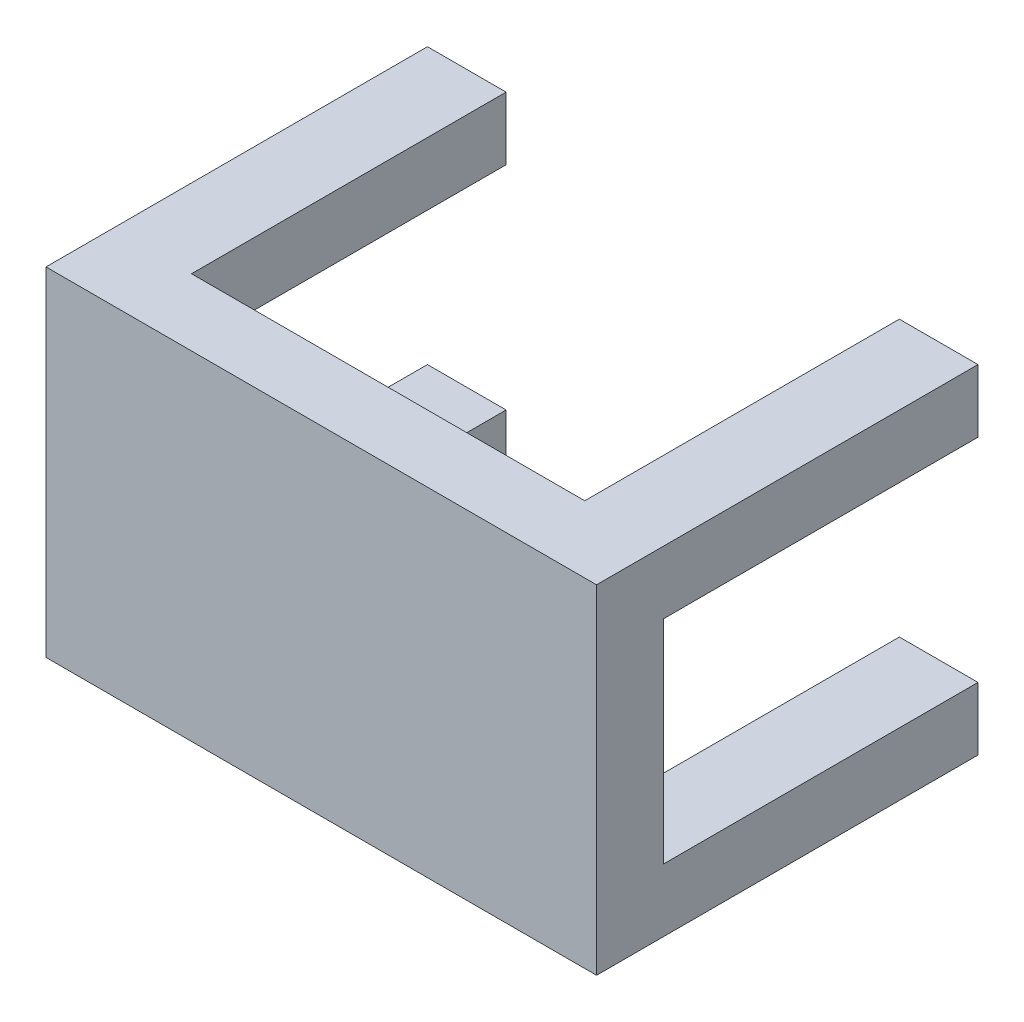
ISO-10303-21;
HEADER;
FILE_DESCRIPTION(('STEP AP214'),'2;1');
FILE_NAME('part.step','',(''),(''),'','','');
FILE_SCHEMA(('AUTOMOTIVE_DESIGN { 1 0 10303 214 1 1 1 1 }'));
ENDSEC;
DATA;
#1=APPLICATION_CONTEXT('core data for automotive mechanical design processes');
#2=APPLICATION_PROTOCOL_DEFINITION('international standard','automotive_design',2000,#1);
#3=PRODUCT_CONTEXT('',#1,'mechanical');
#4=PRODUCT('Part','Part','',(#3));
#5=PRODUCT_RELATED_PRODUCT_CATEGORY('part','',(#4));
#6=PRODUCT_DEFINITION_FORMATION('','',#4);
#7=PRODUCT_DEFINITION_CONTEXT('part definition',#1,'design');
#8=PRODUCT_DEFINITION('design','',#6,#7);
#9=PRODUCT_DEFINITION_SHAPE('','',#8);
#10=(LENGTH_UNIT() NAMED_UNIT(*) SI_UNIT(.MILLI.,.METRE.));
#11=(NAMED_UNIT(*) PLANE_ANGLE_UNIT() SI_UNIT($,.RADIAN.));
#12=(NAMED_UNIT(*) SI_UNIT($,.STERADIAN.) SOLID_ANGLE_UNIT());
#13=UNCERTAINTY_MEASURE_WITH_UNIT(LENGTH_MEASURE(1.E-05),#10,'distance_accuracy_value','');
#14=(GEOMETRIC_REPRESENTATION_CONTEXT(3) GLOBAL_UNCERTAINTY_ASSIGNED_CONTEXT((#13)) GLOBAL_UNIT_ASSIGNED_CONTEXT((#10,
#11,#12)) REPRESENTATION_CONTEXT('',''));
#15=CARTESIAN_POINT('',(0.,0.,0.));
#16=DIRECTION('',(0.,0.,1.));
#17=DIRECTION('',(1.,0.,0.));
#18=AXIS2_PLACEMENT_3D('',#15,#16,#17);
#19=CARTESIAN_POINT('',(-35.,21.5,48.5));
#20=DIRECTION('',(0.,-1.,0.));
#21=DIRECTION('',(0.,0.,-1.));
#22=AXIS2_PLACEMENT_3D('',#19,#20,#21);
#23=PLANE('',#22);
#24=DIRECTION('',(0.,0.,-1.));
#25=VECTOR('',#24,1.);
#26=CARTESIAN_POINT('',(25.,21.5,40.));
#27=LINE('',#26,#25);
#28=CARTESIAN_POINT('',(25.,21.5,40.));
#29=VERTEX_POINT('',#28);
#30=CARTESIAN_POINT('',(25.,21.5,0.));
#31=VERTEX_POINT('',#30);
#32=EDGE_CURVE('E301',#29,#31,#27,.T.);
#33=ORIENTED_EDGE('',*,*,#32,.F.);
#34=DIRECTION('',(1.,0.,0.));
#35=VECTOR('',#34,1.);
#36=CARTESIAN_POINT('',(0.,21.5,40.));
#37=LINE('',#36,#35);
#38=CARTESIAN_POINT('',(-25.,21.5,40.));
#39=VERTEX_POINT('',#38);
#40=EDGE_CURVE('E248',#39,#29,#37,.T.);
#41=ORIENTED_EDGE('',*,*,#40,.F.);
#42=DIRECTION('',(0.,0.,-1.));
#43=VECTOR('',#42,1.);
#44=CARTESIAN_POINT('',(-25.,21.5,40.));
#45=LINE('',#44,#43);
#46=CARTESIAN_POINT('',(-25.,21.5,0.));
#47=VERTEX_POINT('',#46);
#48=EDGE_CURVE('E304',#39,#47,#45,.T.);
#49=ORIENTED_EDGE('',*,*,#48,.T.);
#50=DIRECTION('',(-1.,0.,0.));
#51=VECTOR('',#50,1.);
#52=CARTESIAN_POINT('',(-35.,21.5,0.));
#53=LINE('',#52,#51);
#54=CARTESIAN_POINT('',(-35.,21.5,0.));
#55=VERTEX_POINT('',#54);
#56=EDGE_CURVE('E345',#47,#55,#53,.T.);
#57=ORIENTED_EDGE('',*,*,#56,.T.);
#58=DIRECTION('',(0.,0.,-1.));
#59=VECTOR('',#58,1.);
#60=CARTESIAN_POINT('',(-35.,21.5,48.5));
#61=LINE('',#60,#59);
#62=CARTESIAN_POINT('',(-35.,21.5,48.5));
#63=VERTEX_POINT('',#62);
#64=EDGE_CURVE('E51',#63,#55,#61,.T.);
#65=ORIENTED_EDGE('',*,*,#64,.F.);
#66=DIRECTION('',(-1.,0.,0.));
#67=VECTOR('',#66,1.);
#68=CARTESIAN_POINT('',(-35.,21.5,48.5));
#69=LINE('',#68,#67);
#70=CARTESIAN_POINT('',(35.,21.5,48.5));
#71=VERTEX_POINT('',#70);
#72=EDGE_CURVE('E95',#71,#63,#69,.T.);
#73=ORIENTED_EDGE('',*,*,#72,.F.);
#74=DIRECTION('',(0.,0.,-1.));
#75=VECTOR('',#74,1.);
#76=CARTESIAN_POINT('',(35.,21.5,48.5));
#77=LINE('',#76,#75);
#78=CARTESIAN_POINT('',(35.,21.5,0.));
#79=VERTEX_POINT('',#78);
#80=EDGE_CURVE('E11',#71,#79,#77,.T.);
#81=ORIENTED_EDGE('',*,*,#80,.T.);
#82=EDGE_CURVE('E346',#79,#31,#53,.T.);
#83=ORIENTED_EDGE('',*,*,#82,.T.);
#84=EDGE_LOOP('',(#33,#41,#49,#57,#65,#73,#81,#83));
#85=FACE_BOUND('',#84,.T.);
#86=ADVANCED_FACE('F42',(#85),#23,.F.);
#87=CARTESIAN_POINT('',(0.,0.,0.));
#88=DIRECTION('',(0.,0.,-1.));
#89=DIRECTION('',(-1.,0.,0.));
#90=AXIS2_PLACEMENT_3D('',#87,#88,#89);
#91=PLANE('',#90);
#92=CARTESIAN_POINT('',(-30.,17.5,0.));
#93=DIRECTION('',(0.,0.,-1.));
#94=DIRECTION('',(-1.,0.,0.));
#95=AXIS2_PLACEMENT_3D('',#92,#93,#94);
#96=CIRCLE('',#95,1.25);
#97=CARTESIAN_POINT('',(-31.25,17.5,0.));
#98=VERTEX_POINT('',#97);
#99=EDGE_CURVE('E186',#98,#98,#96,.T.);
#100=ORIENTED_EDGE('',*,*,#99,.F.);
#101=EDGE_LOOP('',(#100));
#102=FACE_BOUND('',#101,.T.);
#103=ORIENTED_EDGE('',*,*,#56,.F.);
#104=DIRECTION('',(0.,-1.,0.));
#105=VECTOR('',#104,1.);
#106=CARTESIAN_POINT('',(-25.,0.,0.));
#107=LINE('',#106,#105);
#108=CARTESIAN_POINT('',(-25.,13.5,0.));
#109=VERTEX_POINT('',#108);
#110=EDGE_CURVE('E280',#47,#109,#107,.T.);
#111=ORIENTED_EDGE('',*,*,#110,.T.);
#112=DIRECTION('',(1.,0.,0.));
#113=VECTOR('',#112,1.);
#114=CARTESIAN_POINT('',(0.,13.5,0.));
#115=LINE('',#114,#113);
#116=CARTESIAN_POINT('',(-35.,13.5,0.));
#117=VERTEX_POINT('',#116);
#118=EDGE_CURVE('E276',#117,#109,#115,.T.);
#119=ORIENTED_EDGE('',*,*,#118,.F.);
#120=DIRECTION('',(0.,-1.,0.));
#121=VECTOR('',#120,1.);
#122=CARTESIAN_POINT('',(-35.,-21.5,0.));
#123=LINE('',#122,#121);
#124=EDGE_CURVE('E351',#55,#117,#123,.T.);
#125=ORIENTED_EDGE('',*,*,#124,.F.);
#126=EDGE_LOOP('',(#103,#111,#119,#125));
#127=FACE_BOUND('',#126,.T.);
#128=ADVANCED_FACE('F374',(#102,#127),#91,.T.);
#129=CARTESIAN_POINT('',(30.,17.5,0.));
#130=DIRECTION('',(0.,0.,-1.));
#131=DIRECTION('',(-1.,0.,0.));
#132=AXIS2_PLACEMENT_3D('',#129,#130,#131);
#133=CIRCLE('',#132,1.25);
#134=CARTESIAN_POINT('',(28.75,17.5,0.));
#135=VERTEX_POINT('',#134);
#136=EDGE_CURVE('E187',#135,#135,#133,.T.);
#137=ORIENTED_EDGE('',*,*,#136,.F.);
#138=EDGE_LOOP('',(#137));
#139=FACE_BOUND('',#138,.T.);
#140=DIRECTION('',(1.,0.,0.));
#141=VECTOR('',#140,1.);
#142=CARTESIAN_POINT('',(0.,13.5,0.));
#143=LINE('',#142,#141);
#144=CARTESIAN_POINT('',(25.,13.5,0.));
#145=VERTEX_POINT('',#144);
#146=CARTESIAN_POINT('',(35.,13.5,0.));
#147=VERTEX_POINT('',#146);
#148=EDGE_CURVE('E221',#145,#147,#143,.T.);
#149=ORIENTED_EDGE('',*,*,#148,.F.);
#150=DIRECTION('',(0.,1.,0.));
#151=VECTOR('',#150,1.);
#152=CARTESIAN_POINT('',(25.,0.,0.));
#153=LINE('',#152,#151);
#154=EDGE_CURVE('E284',#145,#31,#153,.T.);
#155=ORIENTED_EDGE('',*,*,#154,.T.);
#156=ORIENTED_EDGE('',*,*,#82,.F.);
#157=DIRECTION('',(0.,1.,0.));
#158=VECTOR('',#157,1.);
#159=CARTESIAN_POINT('',(35.,-21.5,0.));
#160=LINE('',#159,#158);
#161=EDGE_CURVE('E293',#147,#79,#160,.T.);
#162=ORIENTED_EDGE('',*,*,#161,.F.);
#163=EDGE_LOOP('',(#149,#155,#156,#162));
#164=FACE_BOUND('',#163,.T.);
#165=ADVANCED_FACE('F403',(#139,#164),#91,.T.);
#166=CARTESIAN_POINT('',(-30.,-17.5,0.));
#167=DIRECTION('',(0.,0.,-1.));
#168=DIRECTION('',(-1.,0.,0.));
#169=AXIS2_PLACEMENT_3D('',#166,#167,#168);
#170=CIRCLE('',#169,1.25);
#171=CARTESIAN_POINT('',(-31.25,-17.5,0.));
#172=VERTEX_POINT('',#171);
#173=EDGE_CURVE('E200',#172,#172,#170,.T.);
#174=ORIENTED_EDGE('',*,*,#173,.F.);
#175=EDGE_LOOP('',(#174));
#176=FACE_BOUND('',#175,.T.);
#177=DIRECTION('',(-1.,0.,0.));
#178=VECTOR('',#177,1.);
#179=CARTESIAN_POINT('',(0.,-13.5,0.));
#180=LINE('',#179,#178);
#181=CARTESIAN_POINT('',(-25.,-13.5,0.));
#182=VERTEX_POINT('',#181);
#183=CARTESIAN_POINT('',(-35.,-13.5,0.));
#184=VERTEX_POINT('',#183);
#185=EDGE_CURVE('E273',#182,#184,#180,.T.);
#186=ORIENTED_EDGE('',*,*,#185,.F.);
#187=DIRECTION('',(0.,1.,0.));
#188=VECTOR('',#187,1.);
#189=CARTESIAN_POINT('',(-25.,0.,0.));
#190=LINE('',#189,#188);
#191=CARTESIAN_POINT('',(-25.,-21.5,0.));
#192=VERTEX_POINT('',#191);
#193=EDGE_CURVE('E269',#192,#182,#190,.T.);
#194=ORIENTED_EDGE('',*,*,#193,.F.);
#195=DIRECTION('',(1.,0.,0.));
#196=VECTOR('',#195,1.);
#197=CARTESIAN_POINT('',(-35.,-21.5,0.));
#198=LINE('',#197,#196);
#199=CARTESIAN_POINT('',(-35.,-21.5,0.));
#200=VERTEX_POINT('',#199);
#201=EDGE_CURVE('E332',#200,#192,#198,.T.);
#202=ORIENTED_EDGE('',*,*,#201,.F.);
#203=EDGE_CURVE('E350',#184,#200,#123,.T.);
#204=ORIENTED_EDGE('',*,*,#203,.F.);
#205=EDGE_LOOP('',(#186,#194,#202,#204));
#206=FACE_BOUND('',#205,.T.);
#207=ADVANCED_FACE('F389',(#176,#206),#91,.T.);
#208=CARTESIAN_POINT('',(35.,-21.5,48.5));
#209=DIRECTION('',(-1.,0.,0.));
#210=DIRECTION('',(0.,0.,1.));
#211=AXIS2_PLACEMENT_3D('',#208,#209,#210);
#212=PLANE('',#211);
#213=CARTESIAN_POINT('',(35.,-21.5,0.));
#214=VERTEX_POINT('',#213);
#215=CARTESIAN_POINT('',(35.,-13.5,0.));
#216=VERTEX_POINT('',#215);
#217=EDGE_CURVE('E341',#214,#216,#160,.T.);
#218=ORIENTED_EDGE('',*,*,#217,.T.);
#219=DIRECTION('',(0.,0.,-1.));
#220=VECTOR('',#219,1.);
#221=CARTESIAN_POINT('',(35.,-13.5,40.));
#222=LINE('',#221,#220);
#223=CARTESIAN_POINT('',(35.,-13.5,40.));
#224=VERTEX_POINT('',#223);
#225=EDGE_CURVE('E290',#224,#216,#222,.T.);
#226=ORIENTED_EDGE('',*,*,#225,.F.);
#227=DIRECTION('',(0.,-1.,0.));
#228=VECTOR('',#227,1.);
#229=CARTESIAN_POINT('',(35.,0.,40.));
#230=LINE('',#229,#228);
#231=CARTESIAN_POINT('',(35.,13.5,40.));
#232=VERTEX_POINT('',#231);
#233=EDGE_CURVE('E259',#232,#224,#230,.T.);
#234=ORIENTED_EDGE('',*,*,#233,.F.);
#235=DIRECTION('',(0.,0.,-1.));
#236=VECTOR('',#235,1.);
#237=CARTESIAN_POINT('',(35.,13.5,40.));
#238=LINE('',#237,#236);
#239=EDGE_CURVE('E294',#232,#147,#238,.T.);
#240=ORIENTED_EDGE('',*,*,#239,.T.);
#241=ORIENTED_EDGE('',*,*,#161,.T.);
#242=ORIENTED_EDGE('',*,*,#80,.F.);
#243=DIRECTION('',(0.,1.,0.));
#244=VECTOR('',#243,1.);
#245=CARTESIAN_POINT('',(35.,-21.5,48.5));
#246=LINE('',#245,#244);
#247=CARTESIAN_POINT('',(35.,-21.5,48.5));
#248=VERTEX_POINT('',#247);
#249=EDGE_CURVE('E329',#248,#71,#246,.T.);
#250=ORIENTED_EDGE('',*,*,#249,.F.);
#251=DIRECTION('',(0.,0.,-1.));
#252=VECTOR('',#251,1.);
#253=CARTESIAN_POINT('',(35.,-21.5,48.5));
#254=LINE('',#253,#252);
#255=EDGE_CURVE('E340',#248,#214,#254,.T.);
#256=ORIENTED_EDGE('',*,*,#255,.T.);
#257=EDGE_LOOP('',(#218,#226,#234,#240,#241,#242,#250,#256));
#258=FACE_BOUND('',#257,.T.);
#259=ADVANCED_FACE('F44',(#258),#212,.F.);
#260=CARTESIAN_POINT('',(-35.,-21.5,48.5));
#261=DIRECTION('',(1.,0.,0.));
#262=DIRECTION('',(0.,0.,-1.));
#263=AXIS2_PLACEMENT_3D('',#260,#261,#262);
#264=PLANE('',#263);
#265=ORIENTED_EDGE('',*,*,#124,.T.);
#266=DIRECTION('',(0.,0.,-1.));
#267=VECTOR('',#266,1.);
#268=CARTESIAN_POINT('',(-35.,13.5,40.));
#269=LINE('',#268,#267);
#270=CARTESIAN_POINT('',(-35.,13.5,40.));
#271=VERTEX_POINT('',#270);
#272=EDGE_CURVE('E311',#271,#117,#269,.T.);
#273=ORIENTED_EDGE('',*,*,#272,.F.);
#274=DIRECTION('',(0.,1.,0.));
#275=VECTOR('',#274,1.);
#276=CARTESIAN_POINT('',(-35.,0.,40.));
#277=LINE('',#276,#275);
#278=CARTESIAN_POINT('',(-35.,-13.5,40.));
#279=VERTEX_POINT('',#278);
#280=EDGE_CURVE('E237',#279,#271,#277,.T.);
#281=ORIENTED_EDGE('',*,*,#280,.F.);
#282=DIRECTION('',(0.,0.,-1.));
#283=VECTOR('',#282,1.);
#284=CARTESIAN_POINT('',(-35.,-13.5,40.));
#285=LINE('',#284,#283);
#286=EDGE_CURVE('E314',#279,#184,#285,.T.);
#287=ORIENTED_EDGE('',*,*,#286,.T.);
#288=ORIENTED_EDGE('',*,*,#203,.T.);
#289=DIRECTION('',(0.,0.,-1.));
#290=VECTOR('',#289,1.);
#291=CARTESIAN_POINT('',(-35.,-21.5,48.5));
#292=LINE('',#291,#290);
#293=CARTESIAN_POINT('',(-35.,-21.5,48.5));
#294=VERTEX_POINT('',#293);
#295=EDGE_CURVE('E360',#294,#200,#292,.T.);
#296=ORIENTED_EDGE('',*,*,#295,.F.);
#297=DIRECTION('',(0.,-1.,0.));
#298=VECTOR('',#297,1.);
#299=CARTESIAN_POINT('',(-35.,-21.5,48.5));
#300=LINE('',#299,#298);
#301=EDGE_CURVE('E335',#63,#294,#300,.T.);
#302=ORIENTED_EDGE('',*,*,#301,.F.);
#303=ORIENTED_EDGE('',*,*,#64,.T.);
#304=EDGE_LOOP('',(#265,#273,#281,#287,#288,#296,#302,#303));
#305=FACE_BOUND('',#304,.T.);
#306=ADVANCED_FACE('F368',(#305),#264,.F.);
#307=CARTESIAN_POINT('',(-35.,-21.5,48.5));
#308=DIRECTION('',(0.,1.,0.));
#309=DIRECTION('',(0.,0.,1.));
#310=AXIS2_PLACEMENT_3D('',#307,#308,#309);
#311=PLANE('',#310);
#312=ORIENTED_EDGE('',*,*,#201,.T.);
#313=DIRECTION('',(0.,0.,-1.));
#314=VECTOR('',#313,1.);
#315=CARTESIAN_POINT('',(-25.,-21.5,40.));
#316=LINE('',#315,#314);
#317=CARTESIAN_POINT('',(-25.,-21.5,40.));
#318=VERTEX_POINT('',#317);
#319=EDGE_CURVE('E321',#318,#192,#316,.T.);
#320=ORIENTED_EDGE('',*,*,#319,.F.);
#321=DIRECTION('',(-1.,0.,0.));
#322=VECTOR('',#321,1.);
#323=CARTESIAN_POINT('',(0.,-21.5,40.));
#324=LINE('',#323,#322);
#325=CARTESIAN_POINT('',(25.,-21.5,40.));
#326=VERTEX_POINT('',#325);
#327=EDGE_CURVE('E225',#326,#318,#324,.T.);
#328=ORIENTED_EDGE('',*,*,#327,.F.);
#329=DIRECTION('',(0.,0.,-1.));
#330=VECTOR('',#329,1.);
#331=CARTESIAN_POINT('',(25.,-21.5,40.));
#332=LINE('',#331,#330);
#333=CARTESIAN_POINT('',(25.,-21.5,0.));
#334=VERTEX_POINT('',#333);
#335=EDGE_CURVE('E324',#326,#334,#332,.T.);
#336=ORIENTED_EDGE('',*,*,#335,.T.);
#337=EDGE_CURVE('E88',#334,#214,#198,.T.);
#338=ORIENTED_EDGE('',*,*,#337,.T.);
#339=ORIENTED_EDGE('',*,*,#255,.F.);
#340=DIRECTION('',(1.,0.,0.));
#341=VECTOR('',#340,1.);
#342=CARTESIAN_POINT('',(-35.,-21.5,48.5));
#343=LINE('',#342,#341);
#344=EDGE_CURVE('E67',#294,#248,#343,.T.);
#345=ORIENTED_EDGE('',*,*,#344,.F.);
#346=ORIENTED_EDGE('',*,*,#295,.T.);
#347=EDGE_LOOP('',(#312,#320,#328,#336,#338,#339,#345,#346));
#348=FACE_BOUND('',#347,.T.);
#349=ADVANCED_FACE('F418',(#348),#311,.F.);
#350=CARTESIAN_POINT('',(0.,0.,48.5));
#351=DIRECTION('',(0.,0.,-1.));
#352=DIRECTION('',(-1.,0.,0.));
#353=AXIS2_PLACEMENT_3D('',#350,#351,#352);
#354=PLANE('',#353);
#355=ORIENTED_EDGE('',*,*,#249,.T.);
#356=ORIENTED_EDGE('',*,*,#72,.T.);
#357=ORIENTED_EDGE('',*,*,#301,.T.);
#358=ORIENTED_EDGE('',*,*,#344,.T.);
#359=EDGE_LOOP('',(#355,#356,#357,#358));
#360=FACE_BOUND('',#359,.T.);
#361=ADVANCED_FACE('F420',(#360),#354,.F.);
#362=CARTESIAN_POINT('',(30.,-17.5,0.));
#363=DIRECTION('',(0.,0.,-1.));
#364=DIRECTION('',(-1.,0.,0.));
#365=AXIS2_PLACEMENT_3D('',#362,#363,#364);
#366=CIRCLE('',#365,1.25);
#367=CARTESIAN_POINT('',(28.75,-17.5,0.));
#368=VERTEX_POINT('',#367);
#369=EDGE_CURVE('E208',#368,#368,#366,.T.);
#370=ORIENTED_EDGE('',*,*,#369,.F.);
#371=EDGE_LOOP('',(#370));
#372=FACE_BOUND('',#371,.T.);
#373=DIRECTION('',(-1.,0.,0.));
#374=VECTOR('',#373,1.);
#375=CARTESIAN_POINT('',(0.,-13.5,0.));
#376=LINE('',#375,#374);
#377=CARTESIAN_POINT('',(25.,-13.5,0.));
#378=VERTEX_POINT('',#377);
#379=EDGE_CURVE('E58',#216,#378,#376,.T.);
#380=ORIENTED_EDGE('',*,*,#379,.F.);
#381=ORIENTED_EDGE('',*,*,#217,.F.);
#382=ORIENTED_EDGE('',*,*,#337,.F.);
#383=DIRECTION('',(0.,-1.,0.));
#384=VECTOR('',#383,1.);
#385=CARTESIAN_POINT('',(25.,0.,0.));
#386=LINE('',#385,#384);
#387=EDGE_CURVE('E266',#378,#334,#386,.T.);
#388=ORIENTED_EDGE('',*,*,#387,.F.);
#389=EDGE_LOOP('',(#380,#381,#382,#388));
#390=FACE_BOUND('',#389,.T.);
#391=ADVANCED_FACE('F414',(#372,#390),#91,.T.);
#392=CARTESIAN_POINT('',(0.,-13.5,40.));
#393=DIRECTION('',(0.,-1.,0.));
#394=DIRECTION('',(1.,0.,0.));
#395=AXIS2_PLACEMENT_3D('',#392,#393,#394);
#396=PLANE('',#395);
#397=ORIENTED_EDGE('',*,*,#379,.T.);
#398=DIRECTION('',(0.,0.,-1.));
#399=VECTOR('',#398,1.);
#400=CARTESIAN_POINT('',(25.,-13.5,40.));
#401=LINE('',#400,#399);
#402=CARTESIAN_POINT('',(25.,-13.5,40.));
#403=VERTEX_POINT('',#402);
#404=EDGE_CURVE('E263',#403,#378,#401,.T.);
#405=ORIENTED_EDGE('',*,*,#404,.F.);
#406=DIRECTION('',(-1.,0.,0.));
#407=VECTOR('',#406,1.);
#408=CARTESIAN_POINT('',(0.,-13.5,40.));
#409=LINE('',#408,#407);
#410=EDGE_CURVE('E216',#224,#403,#409,.T.);
#411=ORIENTED_EDGE('',*,*,#410,.F.);
#412=ORIENTED_EDGE('',*,*,#225,.T.);
#413=EDGE_LOOP('',(#397,#405,#411,#412));
#414=FACE_BOUND('',#413,.T.);
#415=ADVANCED_FACE('F423',(#414),#396,.F.);
#416=CARTESIAN_POINT('',(0.,13.5,40.));
#417=DIRECTION('',(0.,1.,0.));
#418=DIRECTION('',(-1.,0.,0.));
#419=AXIS2_PLACEMENT_3D('',#416,#417,#418);
#420=PLANE('',#419);
#421=ORIENTED_EDGE('',*,*,#148,.T.);
#422=ORIENTED_EDGE('',*,*,#239,.F.);
#423=DIRECTION('',(1.,0.,0.));
#424=VECTOR('',#423,1.);
#425=CARTESIAN_POINT('',(0.,13.5,40.));
#426=LINE('',#425,#424);
#427=CARTESIAN_POINT('',(25.,13.5,40.));
#428=VERTEX_POINT('',#427);
#429=EDGE_CURVE('E255',#428,#232,#426,.T.);
#430=ORIENTED_EDGE('',*,*,#429,.F.);
#431=DIRECTION('',(0.,0.,-1.));
#432=VECTOR('',#431,1.);
#433=CARTESIAN_POINT('',(25.,13.5,40.));
#434=LINE('',#433,#432);
#435=EDGE_CURVE('E298',#428,#145,#434,.T.);
#436=ORIENTED_EDGE('',*,*,#435,.T.);
#437=EDGE_LOOP('',(#421,#422,#430,#436));
#438=FACE_BOUND('',#437,.T.);
#439=ADVANCED_FACE('F429',(#438),#420,.F.);
#440=CARTESIAN_POINT('',(25.,0.,40.));
#441=DIRECTION('',(-1.,0.,0.));
#442=DIRECTION('',(0.,0.,1.));
#443=AXIS2_PLACEMENT_3D('',#440,#441,#442);
#444=PLANE('',#443);
#445=ORIENTED_EDGE('',*,*,#154,.F.);
#446=ORIENTED_EDGE('',*,*,#435,.F.);
#447=DIRECTION('',(0.,1.,0.));
#448=VECTOR('',#447,1.);
#449=CARTESIAN_POINT('',(25.,0.,40.));
#450=LINE('',#449,#448);
#451=EDGE_CURVE('E252',#428,#29,#450,.T.);
#452=ORIENTED_EDGE('',*,*,#451,.T.);
#453=ORIENTED_EDGE('',*,*,#32,.T.);
#454=EDGE_LOOP('',(#445,#446,#452,#453));
#455=FACE_BOUND('',#454,.T.);
#456=ADVANCED_FACE('F445',(#455),#444,.T.);
#457=CARTESIAN_POINT('',(-25.,0.,40.));
#458=DIRECTION('',(1.,0.,0.));
#459=DIRECTION('',(0.,0.,-1.));
#460=AXIS2_PLACEMENT_3D('',#457,#458,#459);
#461=PLANE('',#460);
#462=ORIENTED_EDGE('',*,*,#110,.F.);
#463=ORIENTED_EDGE('',*,*,#48,.F.);
#464=DIRECTION('',(0.,-1.,0.));
#465=VECTOR('',#464,1.);
#466=CARTESIAN_POINT('',(-25.,0.,40.));
#467=LINE('',#466,#465);
#468=CARTESIAN_POINT('',(-25.,13.5,40.));
#469=VERTEX_POINT('',#468);
#470=EDGE_CURVE('E245',#39,#469,#467,.T.);
#471=ORIENTED_EDGE('',*,*,#470,.T.);
#472=DIRECTION('',(0.,0.,-1.));
#473=VECTOR('',#472,1.);
#474=CARTESIAN_POINT('',(-25.,13.5,40.));
#475=LINE('',#474,#473);
#476=EDGE_CURVE('E308',#469,#109,#475,.T.);
#477=ORIENTED_EDGE('',*,*,#476,.T.);
#478=EDGE_LOOP('',(#462,#463,#471,#477));
#479=FACE_BOUND('',#478,.T.);
#480=ADVANCED_FACE('F442',(#479),#461,.T.);
#481=CARTESIAN_POINT('',(0.,13.5,40.));
#482=DIRECTION('',(0.,1.,0.));
#483=DIRECTION('',(0.,0.,1.));
#484=AXIS2_PLACEMENT_3D('',#481,#482,#483);
#485=PLANE('',#484);
#486=ORIENTED_EDGE('',*,*,#118,.T.);
#487=ORIENTED_EDGE('',*,*,#476,.F.);
#488=DIRECTION('',(1.,0.,0.));
#489=VECTOR('',#488,1.);
#490=CARTESIAN_POINT('',(0.,13.5,40.));
#491=LINE('',#490,#489);
#492=EDGE_CURVE('E241',#271,#469,#491,.T.);
#493=ORIENTED_EDGE('',*,*,#492,.F.);
#494=ORIENTED_EDGE('',*,*,#272,.T.);
#495=EDGE_LOOP('',(#486,#487,#493,#494));
#496=FACE_BOUND('',#495,.T.);
#497=ADVANCED_FACE('F377',(#496),#485,.F.);
#498=CARTESIAN_POINT('',(0.,-13.5,40.));
#499=DIRECTION('',(0.,-1.,0.));
#500=DIRECTION('',(1.,0.,0.));
#501=AXIS2_PLACEMENT_3D('',#498,#499,#500);
#502=PLANE('',#501);
#503=ORIENTED_EDGE('',*,*,#185,.T.);
#504=ORIENTED_EDGE('',*,*,#286,.F.);
#505=DIRECTION('',(-1.,0.,0.));
#506=VECTOR('',#505,1.);
#507=CARTESIAN_POINT('',(0.,-13.5,40.));
#508=LINE('',#507,#506);
#509=CARTESIAN_POINT('',(-25.,-13.5,40.));
#510=VERTEX_POINT('',#509);
#511=EDGE_CURVE('E233',#510,#279,#508,.T.);
#512=ORIENTED_EDGE('',*,*,#511,.F.);
#513=DIRECTION('',(0.,0.,-1.));
#514=VECTOR('',#513,1.);
#515=CARTESIAN_POINT('',(-25.,-13.5,40.));
#516=LINE('',#515,#514);
#517=EDGE_CURVE('E318',#510,#182,#516,.T.);
#518=ORIENTED_EDGE('',*,*,#517,.T.);
#519=EDGE_LOOP('',(#503,#504,#512,#518));
#520=FACE_BOUND('',#519,.T.);
#521=ADVANCED_FACE('F385',(#520),#502,.F.);
#522=CARTESIAN_POINT('',(-25.,0.,40.));
#523=DIRECTION('',(-1.,0.,0.));
#524=DIRECTION('',(0.,0.,1.));
#525=AXIS2_PLACEMENT_3D('',#522,#523,#524);
#526=PLANE('',#525);
#527=ORIENTED_EDGE('',*,*,#193,.T.);
#528=ORIENTED_EDGE('',*,*,#517,.F.);
#529=DIRECTION('',(0.,1.,0.));
#530=VECTOR('',#529,1.);
#531=CARTESIAN_POINT('',(-25.,0.,40.));
#532=LINE('',#531,#530);
#533=EDGE_CURVE('E229',#318,#510,#532,.T.);
#534=ORIENTED_EDGE('',*,*,#533,.F.);
#535=ORIENTED_EDGE('',*,*,#319,.T.);
#536=EDGE_LOOP('',(#527,#528,#534,#535));
#537=FACE_BOUND('',#536,.T.);
#538=ADVANCED_FACE('F433',(#537),#526,.F.);
#539=CARTESIAN_POINT('',(25.,0.,40.));
#540=DIRECTION('',(1.,0.,0.));
#541=DIRECTION('',(0.,0.,-1.));
#542=AXIS2_PLACEMENT_3D('',#539,#540,#541);
#543=PLANE('',#542);
#544=ORIENTED_EDGE('',*,*,#387,.T.);
#545=ORIENTED_EDGE('',*,*,#335,.F.);
#546=DIRECTION('',(0.,-1.,0.));
#547=VECTOR('',#546,1.);
#548=CARTESIAN_POINT('',(25.,0.,40.));
#549=LINE('',#548,#547);
#550=EDGE_CURVE('E220',#403,#326,#549,.T.);
#551=ORIENTED_EDGE('',*,*,#550,.F.);
#552=ORIENTED_EDGE('',*,*,#404,.T.);
#553=EDGE_LOOP('',(#544,#545,#551,#552));
#554=FACE_BOUND('',#553,.T.);
#555=ADVANCED_FACE('F430',(#554),#543,.F.);
#556=CARTESIAN_POINT('',(0.,0.,40.));
#557=DIRECTION('',(0.,0.,-1.));
#558=DIRECTION('',(-1.,0.,0.));
#559=AXIS2_PLACEMENT_3D('',#556,#557,#558);
#560=PLANE('',#559);
#561=ORIENTED_EDGE('',*,*,#410,.T.);
#562=ORIENTED_EDGE('',*,*,#550,.T.);
#563=ORIENTED_EDGE('',*,*,#327,.T.);
#564=ORIENTED_EDGE('',*,*,#533,.T.);
#565=ORIENTED_EDGE('',*,*,#511,.T.);
#566=ORIENTED_EDGE('',*,*,#280,.T.);
#567=ORIENTED_EDGE('',*,*,#492,.T.);
#568=ORIENTED_EDGE('',*,*,#470,.F.);
#569=ORIENTED_EDGE('',*,*,#40,.T.);
#570=ORIENTED_EDGE('',*,*,#451,.F.);
#571=ORIENTED_EDGE('',*,*,#429,.T.);
#572=ORIENTED_EDGE('',*,*,#233,.T.);
#573=EDGE_LOOP('',(#561,#562,#563,#564,#565,#566,#567,#568,#569,#570,#571,#572));
#574=FACE_BOUND('',#573,.T.);
#575=ADVANCED_FACE('F381',(#574),#560,.T.);
#576=CARTESIAN_POINT('',(30.,-17.5,15.));
#577=DIRECTION('',(0.,0.,-1.));
#578=DIRECTION('',(-1.,0.,0.));
#579=AXIS2_PLACEMENT_3D('',#576,#577,#578);
#580=CONICAL_SURFACE('',#579,1.25,1.02974425867665);
#581=CARTESIAN_POINT('',(30.,-17.5,15.7510757737845));
#582=VERTEX_POINT('',#581);
#583=VERTEX_LOOP('',#582);
#584=FACE_BOUND('',#583,.T.);
#585=CARTESIAN_POINT('',(30.,-17.5,15.));
#586=DIRECTION('',(0.,0.,-1.));
#587=DIRECTION('',(-1.,0.,0.));
#588=AXIS2_PLACEMENT_3D('',#585,#586,#587);
#589=CIRCLE('',#588,1.25);
#590=CARTESIAN_POINT('',(28.75,-17.5,15.));
#591=VERTEX_POINT('',#590);
#592=EDGE_CURVE('E212',#591,#591,#589,.T.);
#593=ORIENTED_EDGE('',*,*,#592,.T.);
#594=EDGE_LOOP('',(#593));
#595=FACE_BOUND('',#594,.T.);
#596=ADVANCED_FACE('F455',(#584,#595),#580,.F.);
#597=CARTESIAN_POINT('',(30.,-17.5,0.));
#598=DIRECTION('',(0.,0.,-1.));
#599=DIRECTION('',(-1.,0.,0.));
#600=AXIS2_PLACEMENT_3D('',#597,#598,#599);
#601=CYLINDRICAL_SURFACE('',#600,1.25);
#602=ORIENTED_EDGE('',*,*,#592,.F.);
#603=EDGE_LOOP('',(#602));
#604=FACE_BOUND('',#603,.T.);
#605=ORIENTED_EDGE('',*,*,#369,.T.);
#606=EDGE_LOOP('',(#605));
#607=FACE_BOUND('',#606,.T.);
#608=ADVANCED_FACE('F458',(#604,#607),#601,.F.);
#609=CARTESIAN_POINT('',(-30.,-17.5,15.));
#610=DIRECTION('',(0.,0.,-1.));
#611=DIRECTION('',(-1.,0.,0.));
#612=AXIS2_PLACEMENT_3D('',#609,#610,#611);
#613=CONICAL_SURFACE('',#612,1.25,1.02974425867665);
#614=CARTESIAN_POINT('',(-30.,-17.5,15.7510757737845));
#615=VERTEX_POINT('',#614);
#616=VERTEX_LOOP('',#615);
#617=FACE_BOUND('',#616,.T.);
#618=CARTESIAN_POINT('',(-30.,-17.5,15.));
#619=DIRECTION('',(0.,0.,-1.));
#620=DIRECTION('',(-1.,0.,0.));
#621=AXIS2_PLACEMENT_3D('',#618,#619,#620);
#622=CIRCLE('',#621,1.25);
#623=CARTESIAN_POINT('',(-31.25,-17.5,15.));
#624=VERTEX_POINT('',#623);
#625=EDGE_CURVE('E204',#624,#624,#622,.T.);
#626=ORIENTED_EDGE('',*,*,#625,.T.);
#627=EDGE_LOOP('',(#626));
#628=FACE_BOUND('',#627,.T.);
#629=ADVANCED_FACE('F462',(#617,#628),#613,.F.);
#630=CARTESIAN_POINT('',(-30.,-17.5,0.));
#631=DIRECTION('',(0.,0.,-1.));
#632=DIRECTION('',(-1.,0.,0.));
#633=AXIS2_PLACEMENT_3D('',#630,#631,#632);
#634=CYLINDRICAL_SURFACE('',#633,1.25);
#635=ORIENTED_EDGE('',*,*,#625,.F.);
#636=EDGE_LOOP('',(#635));
#637=FACE_BOUND('',#636,.T.);
#638=ORIENTED_EDGE('',*,*,#173,.T.);
#639=EDGE_LOOP('',(#638));
#640=FACE_BOUND('',#639,.T.);
#641=ADVANCED_FACE('F466',(#637,#640),#634,.F.);
#642=CARTESIAN_POINT('',(-30.,17.5,15.));
#643=DIRECTION('',(0.,0.,-1.));
#644=DIRECTION('',(-1.,0.,0.));
#645=AXIS2_PLACEMENT_3D('',#642,#643,#644);
#646=CONICAL_SURFACE('',#645,1.25,1.02974425867665);
#647=CARTESIAN_POINT('',(-30.,17.5,15.7510757737845));
#648=VERTEX_POINT('',#647);
#649=VERTEX_LOOP('',#648);
#650=FACE_BOUND('',#649,.T.);
#651=CARTESIAN_POINT('',(-30.,17.5,15.));
#652=DIRECTION('',(0.,0.,-1.));
#653=DIRECTION('',(-1.,0.,0.));
#654=AXIS2_PLACEMENT_3D('',#651,#652,#653);
#655=CIRCLE('',#654,1.25);
#656=CARTESIAN_POINT('',(-31.25,17.5,15.));
#657=VERTEX_POINT('',#656);
#658=EDGE_CURVE('E192',#657,#657,#655,.T.);
#659=ORIENTED_EDGE('',*,*,#658,.T.);
#660=EDGE_LOOP('',(#659));
#661=FACE_BOUND('',#660,.T.);
#662=ADVANCED_FACE('F470',(#650,#661),#646,.F.);
#663=CARTESIAN_POINT('',(-30.,17.5,0.));
#664=DIRECTION('',(0.,0.,-1.));
#665=DIRECTION('',(-1.,0.,0.));
#666=AXIS2_PLACEMENT_3D('',#663,#664,#665);
#667=CYLINDRICAL_SURFACE('',#666,1.25);
#668=ORIENTED_EDGE('',*,*,#658,.F.);
#669=EDGE_LOOP('',(#668));
#670=FACE_BOUND('',#669,.T.);
#671=ORIENTED_EDGE('',*,*,#99,.T.);
#672=EDGE_LOOP('',(#671));
#673=FACE_BOUND('',#672,.T.);
#674=ADVANCED_FACE('F179',(#670,#673),#667,.F.);
#675=CARTESIAN_POINT('',(30.,17.5,15.));
#676=DIRECTION('',(0.,0.,-1.));
#677=DIRECTION('',(-1.,0.,0.));
#678=AXIS2_PLACEMENT_3D('',#675,#676,#677);
#679=CONICAL_SURFACE('',#678,1.25,1.02974425867665);
#680=CARTESIAN_POINT('',(30.,17.5,15.7510757737845));
#681=VERTEX_POINT('',#680);
#682=VERTEX_LOOP('',#681);
#683=FACE_BOUND('',#682,.T.);
#684=CARTESIAN_POINT('',(30.,17.5,15.));
#685=DIRECTION('',(0.,0.,-1.));
#686=DIRECTION('',(-1.,0.,0.));
#687=AXIS2_PLACEMENT_3D('',#684,#685,#686);
#688=CIRCLE('',#687,1.25);
#689=CARTESIAN_POINT('',(28.75,17.5,15.));
#690=VERTEX_POINT('',#689);
#691=EDGE_CURVE('E183',#690,#690,#688,.T.);
#692=ORIENTED_EDGE('',*,*,#691,.T.);
#693=EDGE_LOOP('',(#692));
#694=FACE_BOUND('',#693,.T.);
#695=ADVANCED_FACE('F175',(#683,#694),#679,.F.);
#696=CARTESIAN_POINT('',(30.,17.5,0.));
#697=DIRECTION('',(0.,0.,-1.));
#698=DIRECTION('',(-1.,0.,0.));
#699=AXIS2_PLACEMENT_3D('',#696,#697,#698);
#700=CYLINDRICAL_SURFACE('',#699,1.25);
#701=ORIENTED_EDGE('',*,*,#691,.F.);
#702=EDGE_LOOP('',(#701));
#703=FACE_BOUND('',#702,.T.);
#704=ORIENTED_EDGE('',*,*,#136,.T.);
#705=EDGE_LOOP('',(#704));
#706=FACE_BOUND('',#705,.T.);
#707=ADVANCED_FACE('F178',(#703,#706),#700,.F.);
#708=CLOSED_SHELL('',(#86,#128,#165,#207,#259,#306,#349,#361,#391,#415,#439,#456,#480,#497,#521,
#538,#555,#575,#596,#608,#629,#641,#662,#674,#695,#707));
#709=MANIFOLD_SOLID_BREP('B2',#708);
#710=ADVANCED_BREP_SHAPE_REPRESENTATION('',(#18,#709),#14);
#711=SHAPE_DEFINITION_REPRESENTATION(#9,#710);
ENDSEC;
END-ISO-10303-21;
